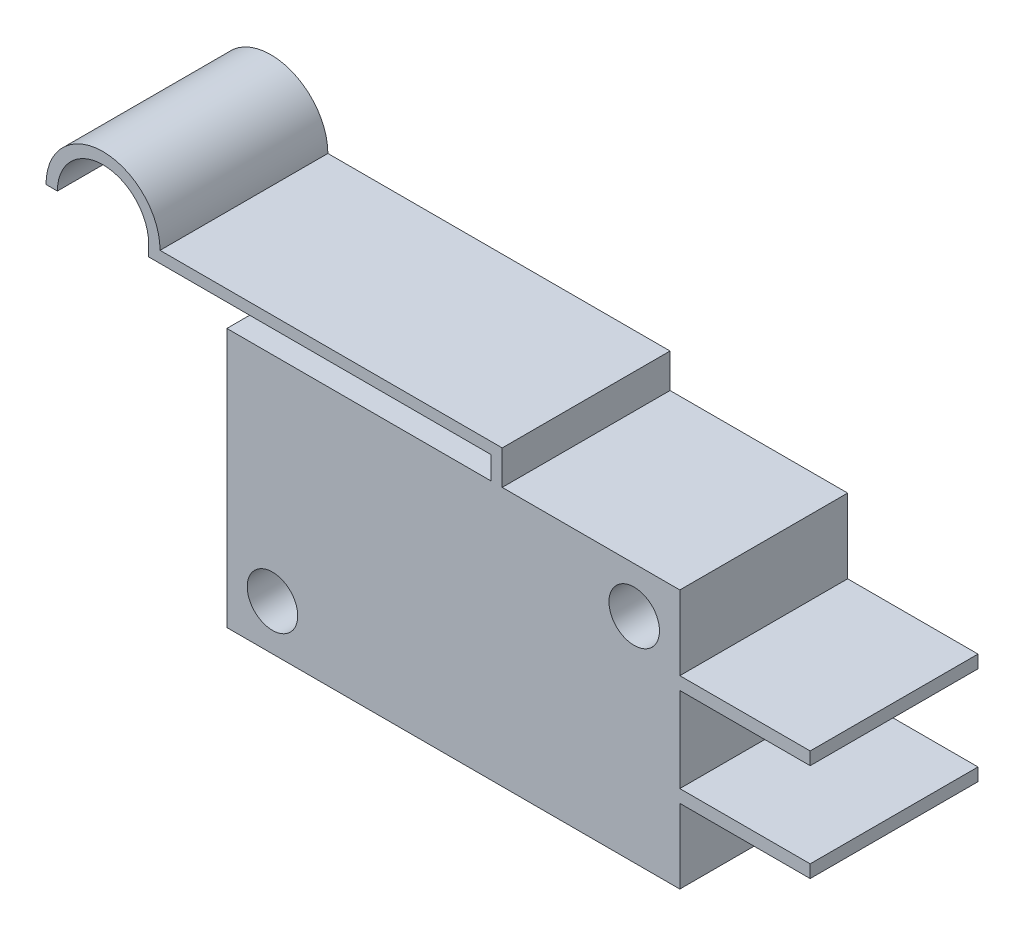
ISO-10303-21;
HEADER;
FILE_DESCRIPTION(('STEP AP214'),'2;1');
FILE_NAME('part.step','',(''),(''),'','','');
FILE_SCHEMA(('AUTOMOTIVE_DESIGN { 1 0 10303 214 1 1 1 1 }'));
ENDSEC;
DATA;
#1=APPLICATION_CONTEXT('core data for automotive mechanical design processes');
#2=APPLICATION_PROTOCOL_DEFINITION('international standard','automotive_design',2000,#1);
#3=PRODUCT_CONTEXT('',#1,'mechanical');
#4=PRODUCT('Part','Part','',(#3));
#5=PRODUCT_RELATED_PRODUCT_CATEGORY('part','',(#4));
#6=PRODUCT_DEFINITION_FORMATION('','',#4);
#7=PRODUCT_DEFINITION_CONTEXT('part definition',#1,'design');
#8=PRODUCT_DEFINITION('design','',#6,#7);
#9=PRODUCT_DEFINITION_SHAPE('','',#8);
#10=(LENGTH_UNIT() NAMED_UNIT(*) SI_UNIT(.MILLI.,.METRE.));
#11=(NAMED_UNIT(*) PLANE_ANGLE_UNIT() SI_UNIT($,.RADIAN.));
#12=(NAMED_UNIT(*) SI_UNIT($,.STERADIAN.) SOLID_ANGLE_UNIT());
#13=UNCERTAINTY_MEASURE_WITH_UNIT(LENGTH_MEASURE(1.E-05),#10,'distance_accuracy_value','');
#14=(GEOMETRIC_REPRESENTATION_CONTEXT(3) GLOBAL_UNCERTAINTY_ASSIGNED_CONTEXT((#13)) GLOBAL_UNIT_ASSIGNED_CONTEXT((#10,
#11,#12)) REPRESENTATION_CONTEXT('',''));
#15=CARTESIAN_POINT('',(0.,0.,0.));
#16=DIRECTION('',(0.,0.,1.));
#17=DIRECTION('',(1.,0.,0.));
#18=AXIS2_PLACEMENT_3D('',#15,#16,#17);
#19=CARTESIAN_POINT('',(0.,15.9,10.3));
#20=DIRECTION('',(0.,-1.,0.));
#21=DIRECTION('',(0.,0.,-1.));
#22=AXIS2_PLACEMENT_3D('',#19,#20,#21);
#23=PLANE('',#22);
#24=DIRECTION('',(0.,0.,1.));
#25=VECTOR('',#24,1.);
#26=CARTESIAN_POINT('',(-11.6,15.9,0.));
#27=LINE('',#26,#25);
#28=CARTESIAN_POINT('',(-11.6,15.9,0.));
#29=VERTEX_POINT('',#28);
#30=CARTESIAN_POINT('',(-11.6,15.9,10.3));
#31=VERTEX_POINT('',#30);
#32=EDGE_CURVE('E246',#29,#31,#27,.T.);
#33=ORIENTED_EDGE('',*,*,#32,.F.);
#34=DIRECTION('',(-1.,0.,0.));
#35=VECTOR('',#34,1.);
#36=CARTESIAN_POINT('',(0.,15.9,0.));
#37=LINE('',#36,#35);
#38=CARTESIAN_POINT('',(-27.8,15.9,0.));
#39=VERTEX_POINT('',#38);
#40=EDGE_CURVE('E334',#29,#39,#37,.T.);
#41=ORIENTED_EDGE('',*,*,#40,.T.);
#42=DIRECTION('',(0.,0.,-1.));
#43=VECTOR('',#42,1.);
#44=CARTESIAN_POINT('',(-27.8,15.9,10.3));
#45=LINE('',#44,#43);
#46=CARTESIAN_POINT('',(-27.8,15.9,10.3));
#47=VERTEX_POINT('',#46);
#48=EDGE_CURVE('E43',#47,#39,#45,.T.);
#49=ORIENTED_EDGE('',*,*,#48,.F.);
#50=DIRECTION('',(-1.,0.,0.));
#51=VECTOR('',#50,1.);
#52=CARTESIAN_POINT('',(0.,15.9,10.3));
#53=LINE('',#52,#51);
#54=EDGE_CURVE('E322',#31,#47,#53,.T.);
#55=ORIENTED_EDGE('',*,*,#54,.F.);
#56=EDGE_LOOP('',(#33,#41,#49,#55));
#57=FACE_BOUND('',#56,.T.);
#58=ADVANCED_FACE('F35',(#57),#23,.F.);
#59=CARTESIAN_POINT('',(0.,0.,10.3));
#60=DIRECTION('',(-1.,0.,0.));
#61=DIRECTION('',(0.,0.,1.));
#62=AXIS2_PLACEMENT_3D('',#59,#60,#61);
#63=PLANE('',#62);
#64=DIRECTION('',(0.,1.,0.));
#65=VECTOR('',#64,1.);
#66=CARTESIAN_POINT('',(0.,0.,10.3));
#67=LINE('',#66,#65);
#68=CARTESIAN_POINT('',(0.,5.34249416077182,10.3));
#69=VERTEX_POINT('',#68);
#70=CARTESIAN_POINT('',(0.,10.5575058392282,10.3));
#71=VERTEX_POINT('',#70);
#72=EDGE_CURVE('E58',#69,#71,#67,.T.);
#73=ORIENTED_EDGE('',*,*,#72,.F.);
#74=DIRECTION('',(0.,0.,1.));
#75=VECTOR('',#74,1.);
#76=CARTESIAN_POINT('',(0.,5.34249416077182,0.));
#77=LINE('',#76,#75);
#78=CARTESIAN_POINT('',(0.,5.34249416077182,0.));
#79=VERTEX_POINT('',#78);
#80=EDGE_CURVE('E266',#79,#69,#77,.T.);
#81=ORIENTED_EDGE('',*,*,#80,.F.);
#82=DIRECTION('',(0.,1.,0.));
#83=VECTOR('',#82,1.);
#84=CARTESIAN_POINT('',(0.,0.,0.));
#85=LINE('',#84,#83);
#86=CARTESIAN_POINT('',(0.,10.5575058392282,0.));
#87=VERTEX_POINT('',#86);
#88=EDGE_CURVE('E335',#79,#87,#85,.T.);
#89=ORIENTED_EDGE('',*,*,#88,.T.);
#90=DIRECTION('',(0.,0.,1.));
#91=VECTOR('',#90,1.);
#92=CARTESIAN_POINT('',(0.,10.5575058392282,0.));
#93=LINE('',#92,#91);
#94=EDGE_CURVE('E291',#87,#71,#93,.T.);
#95=ORIENTED_EDGE('',*,*,#94,.T.);
#96=EDGE_LOOP('',(#73,#81,#89,#95));
#97=FACE_BOUND('',#96,.T.);
#98=ADVANCED_FACE('F381',(#97),#63,.F.);
#99=DIRECTION('',(0.,0.,1.));
#100=VECTOR('',#99,1.);
#101=CARTESIAN_POINT('',(0.,11.3424941607718,0.));
#102=LINE('',#101,#100);
#103=CARTESIAN_POINT('',(0.,11.3424941607718,0.));
#104=VERTEX_POINT('',#103);
#105=CARTESIAN_POINT('',(0.,11.3424941607718,10.3));
#106=VERTEX_POINT('',#105);
#107=EDGE_CURVE('E299',#104,#106,#102,.T.);
#108=ORIENTED_EDGE('',*,*,#107,.F.);
#109=CARTESIAN_POINT('',(0.,15.9,0.));
#110=VERTEX_POINT('',#109);
#111=EDGE_CURVE('E316',#104,#110,#85,.T.);
#112=ORIENTED_EDGE('',*,*,#111,.T.);
#113=DIRECTION('',(0.,0.,-1.));
#114=VECTOR('',#113,1.);
#115=CARTESIAN_POINT('',(0.,15.9,10.3));
#116=LINE('',#115,#114);
#117=CARTESIAN_POINT('',(0.,15.9,10.3));
#118=VERTEX_POINT('',#117);
#119=EDGE_CURVE('E11',#118,#110,#116,.T.);
#120=ORIENTED_EDGE('',*,*,#119,.F.);
#121=EDGE_CURVE('E323',#106,#118,#67,.T.);
#122=ORIENTED_EDGE('',*,*,#121,.F.);
#123=EDGE_LOOP('',(#108,#112,#120,#122));
#124=FACE_BOUND('',#123,.T.);
#125=ADVANCED_FACE('F398',(#124),#63,.F.);
#126=CARTESIAN_POINT('',(0.,0.,0.));
#127=VERTEX_POINT('',#126);
#128=CARTESIAN_POINT('',(0.,4.55750583922818,0.));
#129=VERTEX_POINT('',#128);
#130=EDGE_CURVE('E332',#127,#129,#85,.T.);
#131=ORIENTED_EDGE('',*,*,#130,.T.);
#132=DIRECTION('',(0.,0.,1.));
#133=VECTOR('',#132,1.);
#134=CARTESIAN_POINT('',(0.,4.55750583922818,0.));
#135=LINE('',#134,#133);
#136=CARTESIAN_POINT('',(0.,4.55750583922818,10.3));
#137=VERTEX_POINT('',#136);
#138=EDGE_CURVE('E279',#129,#137,#135,.T.);
#139=ORIENTED_EDGE('',*,*,#138,.T.);
#140=CARTESIAN_POINT('',(0.,0.,10.3));
#141=VERTEX_POINT('',#140);
#142=EDGE_CURVE('E319',#141,#137,#67,.T.);
#143=ORIENTED_EDGE('',*,*,#142,.F.);
#144=DIRECTION('',(0.,0.,-1.));
#145=VECTOR('',#144,1.);
#146=CARTESIAN_POINT('',(0.,0.,10.3));
#147=LINE('',#146,#145);
#148=EDGE_CURVE('E331',#141,#127,#147,.T.);
#149=ORIENTED_EDGE('',*,*,#148,.T.);
#150=EDGE_LOOP('',(#131,#139,#143,#149));
#151=FACE_BOUND('',#150,.T.);
#152=ADVANCED_FACE('F37',(#151),#63,.F.);
#153=CARTESIAN_POINT('',(-10.9,15.9,0.));
#154=VERTEX_POINT('',#153);
#155=EDGE_CURVE('E336',#110,#154,#37,.T.);
#156=ORIENTED_EDGE('',*,*,#155,.T.);
#157=DIRECTION('',(0.,0.,1.));
#158=VECTOR('',#157,1.);
#159=CARTESIAN_POINT('',(-10.9,15.9,0.));
#160=LINE('',#159,#158);
#161=CARTESIAN_POINT('',(-10.9,15.9,10.3));
#162=VERTEX_POINT('',#161);
#163=EDGE_CURVE('E244',#154,#162,#160,.T.);
#164=ORIENTED_EDGE('',*,*,#163,.T.);
#165=EDGE_CURVE('E324',#118,#162,#53,.T.);
#166=ORIENTED_EDGE('',*,*,#165,.F.);
#167=ORIENTED_EDGE('',*,*,#119,.T.);
#168=EDGE_LOOP('',(#156,#164,#166,#167));
#169=FACE_BOUND('',#168,.T.);
#170=ADVANCED_FACE('F404',(#169),#23,.F.);
#171=CARTESIAN_POINT('',(-27.8,0.,10.3));
#172=DIRECTION('',(1.,0.,0.));
#173=DIRECTION('',(0.,0.,-1.));
#174=AXIS2_PLACEMENT_3D('',#171,#172,#173);
#175=PLANE('',#174);
#176=DIRECTION('',(0.,-1.,0.));
#177=VECTOR('',#176,1.);
#178=CARTESIAN_POINT('',(-27.8,0.,0.));
#179=LINE('',#178,#177);
#180=CARTESIAN_POINT('',(-27.8,0.,0.));
#181=VERTEX_POINT('',#180);
#182=EDGE_CURVE('E339',#39,#181,#179,.T.);
#183=ORIENTED_EDGE('',*,*,#182,.T.);
#184=DIRECTION('',(0.,0.,-1.));
#185=VECTOR('',#184,1.);
#186=CARTESIAN_POINT('',(-27.8,0.,10.3));
#187=LINE('',#186,#185);
#188=CARTESIAN_POINT('',(-27.8,0.,10.3));
#189=VERTEX_POINT('',#188);
#190=EDGE_CURVE('E345',#189,#181,#187,.T.);
#191=ORIENTED_EDGE('',*,*,#190,.F.);
#192=DIRECTION('',(0.,-1.,0.));
#193=VECTOR('',#192,1.);
#194=CARTESIAN_POINT('',(-27.8,0.,10.3));
#195=LINE('',#194,#193);
#196=EDGE_CURVE('E327',#47,#189,#195,.T.);
#197=ORIENTED_EDGE('',*,*,#196,.F.);
#198=ORIENTED_EDGE('',*,*,#48,.T.);
#199=EDGE_LOOP('',(#183,#191,#197,#198));
#200=FACE_BOUND('',#199,.T.);
#201=ADVANCED_FACE('F352',(#200),#175,.F.);
#202=CARTESIAN_POINT('',(0.,0.,10.3));
#203=DIRECTION('',(0.,1.,0.));
#204=DIRECTION('',(-1.,0.,0.));
#205=AXIS2_PLACEMENT_3D('',#202,#203,#204);
#206=PLANE('',#205);
#207=DIRECTION('',(1.,0.,0.));
#208=VECTOR('',#207,1.);
#209=CARTESIAN_POINT('',(0.,0.,0.));
#210=LINE('',#209,#208);
#211=EDGE_CURVE('E341',#181,#127,#210,.T.);
#212=ORIENTED_EDGE('',*,*,#211,.T.);
#213=ORIENTED_EDGE('',*,*,#148,.F.);
#214=DIRECTION('',(1.,0.,0.));
#215=VECTOR('',#214,1.);
#216=CARTESIAN_POINT('',(0.,0.,10.3));
#217=LINE('',#216,#215);
#218=EDGE_CURVE('E329',#189,#141,#217,.T.);
#219=ORIENTED_EDGE('',*,*,#218,.F.);
#220=ORIENTED_EDGE('',*,*,#190,.T.);
#221=EDGE_LOOP('',(#212,#213,#219,#220));
#222=FACE_BOUND('',#221,.T.);
#223=ADVANCED_FACE('F362',(#222),#206,.F.);
#224=CARTESIAN_POINT('',(0.,0.,10.3));
#225=DIRECTION('',(0.,0.,1.));
#226=DIRECTION('',(1.,0.,0.));
#227=AXIS2_PLACEMENT_3D('',#224,#225,#226);
#228=PLANE('',#227);
#229=CARTESIAN_POINT('',(-25.,2.8,10.3));
#230=DIRECTION('',(0.,0.,1.));
#231=DIRECTION('',(1.,0.,0.));
#232=AXIS2_PLACEMENT_3D('',#229,#230,#231);
#233=CIRCLE('',#232,1.55);
#234=CARTESIAN_POINT('',(-23.45,2.8,10.3));
#235=VERTEX_POINT('',#234);
#236=EDGE_CURVE('E301',#235,#235,#233,.T.);
#237=ORIENTED_EDGE('',*,*,#236,.F.);
#238=EDGE_LOOP('',(#237));
#239=FACE_BOUND('',#238,.T.);
#240=CARTESIAN_POINT('',(-2.8,13.1,10.3));
#241=DIRECTION('',(0.,0.,1.));
#242=DIRECTION('',(1.,0.,0.));
#243=AXIS2_PLACEMENT_3D('',#240,#241,#242);
#244=CIRCLE('',#243,1.55);
#245=CARTESIAN_POINT('',(-1.25,13.1,10.3));
#246=VERTEX_POINT('',#245);
#247=EDGE_CURVE('E310',#246,#246,#244,.T.);
#248=ORIENTED_EDGE('',*,*,#247,.F.);
#249=EDGE_LOOP('',(#248));
#250=FACE_BOUND('',#249,.T.);
#251=ORIENTED_EDGE('',*,*,#142,.T.);
#252=DIRECTION('',(1.,0.,0.));
#253=VECTOR('',#252,1.);
#254=CARTESIAN_POINT('',(0.,4.55750583922818,10.3));
#255=LINE('',#254,#253);
#256=CARTESIAN_POINT('',(8.,4.55750583922818,10.3));
#257=VERTEX_POINT('',#256);
#258=EDGE_CURVE('E269',#137,#257,#255,.T.);
#259=ORIENTED_EDGE('',*,*,#258,.T.);
#260=DIRECTION('',(0.,1.,0.));
#261=VECTOR('',#260,1.);
#262=CARTESIAN_POINT('',(8.,5.34249416077182,10.3));
#263=LINE('',#262,#261);
#264=CARTESIAN_POINT('',(8.,5.34249416077182,10.3));
#265=VERTEX_POINT('',#264);
#266=EDGE_CURVE('E260',#257,#265,#263,.T.);
#267=ORIENTED_EDGE('',*,*,#266,.T.);
#268=DIRECTION('',(-1.,0.,0.));
#269=VECTOR('',#268,1.);
#270=CARTESIAN_POINT('',(0.,5.34249416077182,10.3));
#271=LINE('',#270,#269);
#272=EDGE_CURVE('E241',#265,#69,#271,.T.);
#273=ORIENTED_EDGE('',*,*,#272,.T.);
#274=ORIENTED_EDGE('',*,*,#72,.T.);
#275=DIRECTION('',(1.,0.,0.));
#276=VECTOR('',#275,1.);
#277=CARTESIAN_POINT('',(0.,10.5575058392282,10.3));
#278=LINE('',#277,#276);
#279=CARTESIAN_POINT('',(8.,10.5575058392282,10.3));
#280=VERTEX_POINT('',#279);
#281=EDGE_CURVE('E276',#71,#280,#278,.T.);
#282=ORIENTED_EDGE('',*,*,#281,.T.);
#283=DIRECTION('',(0.,1.,0.));
#284=VECTOR('',#283,1.);
#285=CARTESIAN_POINT('',(8.,10.5575058392282,10.3));
#286=LINE('',#285,#284);
#287=CARTESIAN_POINT('',(8.,11.3424941607718,10.3));
#288=VERTEX_POINT('',#287);
#289=EDGE_CURVE('E294',#280,#288,#286,.T.);
#290=ORIENTED_EDGE('',*,*,#289,.T.);
#291=DIRECTION('',(-1.,0.,0.));
#292=VECTOR('',#291,1.);
#293=CARTESIAN_POINT('',(0.,11.3424941607718,10.3));
#294=LINE('',#293,#292);
#295=EDGE_CURVE('E286',#288,#106,#294,.T.);
#296=ORIENTED_EDGE('',*,*,#295,.T.);
#297=ORIENTED_EDGE('',*,*,#121,.T.);
#298=ORIENTED_EDGE('',*,*,#165,.T.);
#299=DIRECTION('',(0.,1.,0.));
#300=VECTOR('',#299,1.);
#301=CARTESIAN_POINT('',(-10.9,18.,10.3));
#302=LINE('',#301,#300);
#303=CARTESIAN_POINT('',(-10.9,18.,10.3));
#304=VERTEX_POINT('',#303);
#305=EDGE_CURVE('E50',#162,#304,#302,.T.);
#306=ORIENTED_EDGE('',*,*,#305,.T.);
#307=DIRECTION('',(-1.,0.,0.));
#308=VECTOR('',#307,1.);
#309=CARTESIAN_POINT('',(-31.9,18.,10.3));
#310=LINE('',#309,#308);
#311=CARTESIAN_POINT('',(-31.9,18.,10.3));
#312=VERTEX_POINT('',#311);
#313=EDGE_CURVE('E207',#304,#312,#310,.T.);
#314=ORIENTED_EDGE('',*,*,#313,.T.);
#315=CARTESIAN_POINT('',(-35.4,18.,10.3));
#316=DIRECTION('',(0.,0.,1.));
#317=DIRECTION('',(1.,0.,0.));
#318=AXIS2_PLACEMENT_3D('',#315,#316,#317);
#319=CIRCLE('',#318,3.5);
#320=CARTESIAN_POINT('',(-38.9,18.,10.3));
#321=VERTEX_POINT('',#320);
#322=EDGE_CURVE('E224',#312,#321,#319,.T.);
#323=ORIENTED_EDGE('',*,*,#322,.T.);
#324=DIRECTION('',(1.,0.,0.));
#325=VECTOR('',#324,1.);
#326=CARTESIAN_POINT('',(-38.9,18.,10.3));
#327=LINE('',#326,#325);
#328=CARTESIAN_POINT('',(-38.2,18.,10.3));
#329=VERTEX_POINT('',#328);
#330=EDGE_CURVE('E185',#321,#329,#327,.T.);
#331=ORIENTED_EDGE('',*,*,#330,.T.);
#332=CARTESIAN_POINT('',(-35.4,18.,10.3));
#333=DIRECTION('',(0.,0.,-1.));
#334=DIRECTION('',(1.,0.,0.));
#335=AXIS2_PLACEMENT_3D('',#332,#333,#334);
#336=CIRCLE('',#335,2.8);
#337=CARTESIAN_POINT('',(-32.6,18.,10.3));
#338=VERTEX_POINT('',#337);
#339=EDGE_CURVE('E227',#329,#338,#336,.T.);
#340=ORIENTED_EDGE('',*,*,#339,.T.);
#341=DIRECTION('',(0.,-1.,0.));
#342=VECTOR('',#341,1.);
#343=CARTESIAN_POINT('',(-32.6,18.,10.3));
#344=LINE('',#343,#342);
#345=CARTESIAN_POINT('',(-32.6,17.3,10.3));
#346=VERTEX_POINT('',#345);
#347=EDGE_CURVE('E230',#338,#346,#344,.T.);
#348=ORIENTED_EDGE('',*,*,#347,.T.);
#349=DIRECTION('',(1.,0.,0.));
#350=VECTOR('',#349,1.);
#351=CARTESIAN_POINT('',(-31.8963387594044,17.3,10.3));
#352=LINE('',#351,#350);
#353=CARTESIAN_POINT('',(-11.6,17.3,10.3));
#354=VERTEX_POINT('',#353);
#355=EDGE_CURVE('E233',#346,#354,#352,.T.);
#356=ORIENTED_EDGE('',*,*,#355,.T.);
#357=DIRECTION('',(0.,-1.,0.));
#358=VECTOR('',#357,1.);
#359=CARTESIAN_POINT('',(-11.6,17.3,10.3));
#360=LINE('',#359,#358);
#361=EDGE_CURVE('E236',#354,#31,#360,.T.);
#362=ORIENTED_EDGE('',*,*,#361,.T.);
#363=ORIENTED_EDGE('',*,*,#54,.T.);
#364=ORIENTED_EDGE('',*,*,#196,.T.);
#365=ORIENTED_EDGE('',*,*,#218,.T.);
#366=EDGE_LOOP('',(#251,#259,#267,#273,#274,#282,#290,#296,#297,#298,#306,#314,#323,#331,#340,
#348,#356,#362,#363,#364,#365));
#367=FACE_BOUND('',#366,.T.);
#368=ADVANCED_FACE('F369',(#239,#250,#367),#228,.T.);
#369=CARTESIAN_POINT('',(0.,0.,0.));
#370=DIRECTION('',(0.,0.,1.));
#371=DIRECTION('',(1.,0.,0.));
#372=AXIS2_PLACEMENT_3D('',#369,#370,#371);
#373=PLANE('',#372);
#374=CARTESIAN_POINT('',(-25.,2.8,0.));
#375=DIRECTION('',(0.,0.,1.));
#376=DIRECTION('',(1.,0.,0.));
#377=AXIS2_PLACEMENT_3D('',#374,#375,#376);
#378=CIRCLE('',#377,1.55);
#379=CARTESIAN_POINT('',(-23.45,2.8,0.));
#380=VERTEX_POINT('',#379);
#381=EDGE_CURVE('E307',#380,#380,#378,.T.);
#382=ORIENTED_EDGE('',*,*,#381,.T.);
#383=EDGE_LOOP('',(#382));
#384=FACE_BOUND('',#383,.T.);
#385=CARTESIAN_POINT('',(-2.8,13.1,0.));
#386=DIRECTION('',(0.,0.,1.));
#387=DIRECTION('',(1.,0.,0.));
#388=AXIS2_PLACEMENT_3D('',#385,#386,#387);
#389=CIRCLE('',#388,1.55);
#390=CARTESIAN_POINT('',(-1.25,13.1,0.));
#391=VERTEX_POINT('',#390);
#392=EDGE_CURVE('E313',#391,#391,#389,.T.);
#393=ORIENTED_EDGE('',*,*,#392,.T.);
#394=EDGE_LOOP('',(#393));
#395=FACE_BOUND('',#394,.T.);
#396=ORIENTED_EDGE('',*,*,#130,.F.);
#397=ORIENTED_EDGE('',*,*,#211,.F.);
#398=ORIENTED_EDGE('',*,*,#182,.F.);
#399=ORIENTED_EDGE('',*,*,#40,.F.);
#400=DIRECTION('',(0.,-1.,0.));
#401=VECTOR('',#400,1.);
#402=CARTESIAN_POINT('',(-11.6,17.3,0.));
#403=LINE('',#402,#401);
#404=CARTESIAN_POINT('',(-11.6,17.3,0.));
#405=VERTEX_POINT('',#404);
#406=EDGE_CURVE('E218',#405,#29,#403,.T.);
#407=ORIENTED_EDGE('',*,*,#406,.F.);
#408=DIRECTION('',(1.,0.,0.));
#409=VECTOR('',#408,1.);
#410=CARTESIAN_POINT('',(-32.6,17.3,0.));
#411=LINE('',#410,#409);
#412=CARTESIAN_POINT('',(-32.6,17.3,0.));
#413=VERTEX_POINT('',#412);
#414=EDGE_CURVE('E216',#413,#405,#411,.T.);
#415=ORIENTED_EDGE('',*,*,#414,.F.);
#416=DIRECTION('',(0.,-1.,0.));
#417=VECTOR('',#416,1.);
#418=CARTESIAN_POINT('',(-32.6,18.,0.));
#419=LINE('',#418,#417);
#420=CARTESIAN_POINT('',(-32.6,18.,0.));
#421=VERTEX_POINT('',#420);
#422=EDGE_CURVE('E213',#421,#413,#419,.T.);
#423=ORIENTED_EDGE('',*,*,#422,.F.);
#424=CARTESIAN_POINT('',(-35.4,18.,0.));
#425=DIRECTION('',(0.,0.,-1.));
#426=DIRECTION('',(1.,0.,0.));
#427=AXIS2_PLACEMENT_3D('',#424,#425,#426);
#428=CIRCLE('',#427,2.8);
#429=CARTESIAN_POINT('',(-38.2,18.,0.));
#430=VERTEX_POINT('',#429);
#431=EDGE_CURVE('E202',#430,#421,#428,.T.);
#432=ORIENTED_EDGE('',*,*,#431,.F.);
#433=DIRECTION('',(1.,0.,0.));
#434=VECTOR('',#433,1.);
#435=CARTESIAN_POINT('',(-38.9,18.,0.));
#436=LINE('',#435,#434);
#437=CARTESIAN_POINT('',(-38.9,18.,0.));
#438=VERTEX_POINT('',#437);
#439=EDGE_CURVE('E183',#438,#430,#436,.T.);
#440=ORIENTED_EDGE('',*,*,#439,.F.);
#441=CARTESIAN_POINT('',(-35.4,18.,0.));
#442=DIRECTION('',(0.,0.,1.));
#443=DIRECTION('',(1.,0.,0.));
#444=AXIS2_PLACEMENT_3D('',#441,#442,#443);
#445=CIRCLE('',#444,3.5);
#446=CARTESIAN_POINT('',(-31.9,18.,0.));
#447=VERTEX_POINT('',#446);
#448=EDGE_CURVE('E199',#447,#438,#445,.T.);
#449=ORIENTED_EDGE('',*,*,#448,.F.);
#450=DIRECTION('',(-1.,0.,0.));
#451=VECTOR('',#450,1.);
#452=CARTESIAN_POINT('',(-22.4524642145679,18.,0.));
#453=LINE('',#452,#451);
#454=CARTESIAN_POINT('',(-10.9,18.,0.));
#455=VERTEX_POINT('',#454);
#456=EDGE_CURVE('E191',#455,#447,#453,.T.);
#457=ORIENTED_EDGE('',*,*,#456,.F.);
#458=DIRECTION('',(0.,1.,0.));
#459=VECTOR('',#458,1.);
#460=CARTESIAN_POINT('',(-10.9,18.,0.));
#461=LINE('',#460,#459);
#462=EDGE_CURVE('E220',#154,#455,#461,.T.);
#463=ORIENTED_EDGE('',*,*,#462,.F.);
#464=ORIENTED_EDGE('',*,*,#155,.F.);
#465=ORIENTED_EDGE('',*,*,#111,.F.);
#466=DIRECTION('',(-1.,0.,0.));
#467=VECTOR('',#466,1.);
#468=CARTESIAN_POINT('',(0.,11.3424941607718,0.));
#469=LINE('',#468,#467);
#470=CARTESIAN_POINT('',(8.,11.3424941607718,0.));
#471=VERTEX_POINT('',#470);
#472=EDGE_CURVE('E289',#471,#104,#469,.T.);
#473=ORIENTED_EDGE('',*,*,#472,.F.);
#474=DIRECTION('',(0.,1.,0.));
#475=VECTOR('',#474,1.);
#476=CARTESIAN_POINT('',(8.,10.5575058392282,0.));
#477=LINE('',#476,#475);
#478=CARTESIAN_POINT('',(8.,10.5575058392282,0.));
#479=VERTEX_POINT('',#478);
#480=EDGE_CURVE('E285',#479,#471,#477,.T.);
#481=ORIENTED_EDGE('',*,*,#480,.F.);
#482=DIRECTION('',(1.,0.,0.));
#483=VECTOR('',#482,1.);
#484=CARTESIAN_POINT('',(0.,10.5575058392282,0.));
#485=LINE('',#484,#483);
#486=EDGE_CURVE('E282',#87,#479,#485,.T.);
#487=ORIENTED_EDGE('',*,*,#486,.F.);
#488=ORIENTED_EDGE('',*,*,#88,.F.);
#489=DIRECTION('',(-1.,0.,0.));
#490=VECTOR('',#489,1.);
#491=CARTESIAN_POINT('',(0.,5.34249416077182,0.));
#492=LINE('',#491,#490);
#493=CARTESIAN_POINT('',(8.,5.34249416077182,0.));
#494=VERTEX_POINT('',#493);
#495=EDGE_CURVE('E256',#494,#79,#492,.T.);
#496=ORIENTED_EDGE('',*,*,#495,.F.);
#497=DIRECTION('',(0.,1.,0.));
#498=VECTOR('',#497,1.);
#499=CARTESIAN_POINT('',(8.,5.34249416077182,0.));
#500=LINE('',#499,#498);
#501=CARTESIAN_POINT('',(8.,4.55750583922818,0.));
#502=VERTEX_POINT('',#501);
#503=EDGE_CURVE('E263',#502,#494,#500,.T.);
#504=ORIENTED_EDGE('',*,*,#503,.F.);
#505=DIRECTION('',(1.,0.,0.));
#506=VECTOR('',#505,1.);
#507=CARTESIAN_POINT('',(0.,4.55750583922818,0.));
#508=LINE('',#507,#506);
#509=EDGE_CURVE('E259',#129,#502,#508,.T.);
#510=ORIENTED_EDGE('',*,*,#509,.F.);
#511=EDGE_LOOP('',(#396,#397,#398,#399,#407,#415,#423,#432,#440,#449,#457,#463,#464,#465,#473,
#481,#487,#488,#496,#504,#510));
#512=FACE_BOUND('',#511,.T.);
#513=ADVANCED_FACE('F197',(#384,#395,#512),#373,.F.);
#514=CARTESIAN_POINT('',(-2.8,13.1,0.));
#515=DIRECTION('',(0.,0.,1.));
#516=DIRECTION('',(1.,0.,0.));
#517=AXIS2_PLACEMENT_3D('',#514,#515,#516);
#518=CYLINDRICAL_SURFACE('',#517,1.55);
#519=ORIENTED_EDGE('',*,*,#392,.F.);
#520=EDGE_LOOP('',(#519));
#521=FACE_BOUND('',#520,.T.);
#522=ORIENTED_EDGE('',*,*,#247,.T.);
#523=EDGE_LOOP('',(#522));
#524=FACE_BOUND('',#523,.T.);
#525=ADVANCED_FACE('F450',(#521,#524),#518,.F.);
#526=CARTESIAN_POINT('',(-25.,2.8,0.));
#527=DIRECTION('',(0.,0.,1.));
#528=DIRECTION('',(1.,0.,0.));
#529=AXIS2_PLACEMENT_3D('',#526,#527,#528);
#530=CYLINDRICAL_SURFACE('',#529,1.55);
#531=ORIENTED_EDGE('',*,*,#381,.F.);
#532=EDGE_LOOP('',(#531));
#533=FACE_BOUND('',#532,.T.);
#534=ORIENTED_EDGE('',*,*,#236,.T.);
#535=EDGE_LOOP('',(#534));
#536=FACE_BOUND('',#535,.T.);
#537=ADVANCED_FACE('F445',(#533,#536),#530,.F.);
#538=CARTESIAN_POINT('',(0.,11.3424941607718,0.));
#539=DIRECTION('',(0.,1.,0.));
#540=DIRECTION('',(0.,0.,1.));
#541=AXIS2_PLACEMENT_3D('',#538,#539,#540);
#542=PLANE('',#541);
#543=ORIENTED_EDGE('',*,*,#295,.F.);
#544=DIRECTION('',(0.,0.,1.));
#545=VECTOR('',#544,1.);
#546=CARTESIAN_POINT('',(8.,11.3424941607718,0.));
#547=LINE('',#546,#545);
#548=EDGE_CURVE('E302',#471,#288,#547,.T.);
#549=ORIENTED_EDGE('',*,*,#548,.F.);
#550=ORIENTED_EDGE('',*,*,#472,.T.);
#551=ORIENTED_EDGE('',*,*,#107,.T.);
#552=EDGE_LOOP('',(#543,#549,#550,#551));
#553=FACE_BOUND('',#552,.T.);
#554=ADVANCED_FACE('F395',(#553),#542,.T.);
#555=CARTESIAN_POINT('',(8.,10.5575058392282,0.));
#556=DIRECTION('',(1.,0.,0.));
#557=DIRECTION('',(0.,0.,-1.));
#558=AXIS2_PLACEMENT_3D('',#555,#556,#557);
#559=PLANE('',#558);
#560=ORIENTED_EDGE('',*,*,#289,.F.);
#561=DIRECTION('',(0.,0.,1.));
#562=VECTOR('',#561,1.);
#563=CARTESIAN_POINT('',(8.,10.5575058392282,0.));
#564=LINE('',#563,#562);
#565=EDGE_CURVE('E304',#479,#280,#564,.T.);
#566=ORIENTED_EDGE('',*,*,#565,.F.);
#567=ORIENTED_EDGE('',*,*,#480,.T.);
#568=ORIENTED_EDGE('',*,*,#548,.T.);
#569=EDGE_LOOP('',(#560,#566,#567,#568));
#570=FACE_BOUND('',#569,.T.);
#571=ADVANCED_FACE('F391',(#570),#559,.T.);
#572=CARTESIAN_POINT('',(0.,10.5575058392282,0.));
#573=DIRECTION('',(0.,-1.,0.));
#574=DIRECTION('',(0.,0.,-1.));
#575=AXIS2_PLACEMENT_3D('',#572,#573,#574);
#576=PLANE('',#575);
#577=ORIENTED_EDGE('',*,*,#281,.F.);
#578=ORIENTED_EDGE('',*,*,#94,.F.);
#579=ORIENTED_EDGE('',*,*,#486,.T.);
#580=ORIENTED_EDGE('',*,*,#565,.T.);
#581=EDGE_LOOP('',(#577,#578,#579,#580));
#582=FACE_BOUND('',#581,.T.);
#583=ADVANCED_FACE('F385',(#582),#576,.T.);
#584=CARTESIAN_POINT('',(0.,5.34249416077182,0.));
#585=DIRECTION('',(0.,1.,0.));
#586=DIRECTION('',(0.,0.,1.));
#587=AXIS2_PLACEMENT_3D('',#584,#585,#586);
#588=PLANE('',#587);
#589=ORIENTED_EDGE('',*,*,#272,.F.);
#590=DIRECTION('',(0.,0.,1.));
#591=VECTOR('',#590,1.);
#592=CARTESIAN_POINT('',(8.,5.34249416077182,0.));
#593=LINE('',#592,#591);
#594=EDGE_CURVE('E274',#494,#265,#593,.T.);
#595=ORIENTED_EDGE('',*,*,#594,.F.);
#596=ORIENTED_EDGE('',*,*,#495,.T.);
#597=ORIENTED_EDGE('',*,*,#80,.T.);
#598=EDGE_LOOP('',(#589,#595,#596,#597));
#599=FACE_BOUND('',#598,.T.);
#600=ADVANCED_FACE('F379',(#599),#588,.T.);
#601=CARTESIAN_POINT('',(8.,5.34249416077182,0.));
#602=DIRECTION('',(1.,0.,0.));
#603=DIRECTION('',(0.,0.,-1.));
#604=AXIS2_PLACEMENT_3D('',#601,#602,#603);
#605=PLANE('',#604);
#606=ORIENTED_EDGE('',*,*,#266,.F.);
#607=DIRECTION('',(0.,0.,1.));
#608=VECTOR('',#607,1.);
#609=CARTESIAN_POINT('',(8.,4.55750583922818,0.));
#610=LINE('',#609,#608);
#611=EDGE_CURVE('E277',#502,#257,#610,.T.);
#612=ORIENTED_EDGE('',*,*,#611,.F.);
#613=ORIENTED_EDGE('',*,*,#503,.T.);
#614=ORIENTED_EDGE('',*,*,#594,.T.);
#615=EDGE_LOOP('',(#606,#612,#613,#614));
#616=FACE_BOUND('',#615,.T.);
#617=ADVANCED_FACE('F375',(#616),#605,.T.);
#618=CARTESIAN_POINT('',(0.,4.55750583922818,0.));
#619=DIRECTION('',(0.,-1.,0.));
#620=DIRECTION('',(0.,0.,-1.));
#621=AXIS2_PLACEMENT_3D('',#618,#619,#620);
#622=PLANE('',#621);
#623=ORIENTED_EDGE('',*,*,#258,.F.);
#624=ORIENTED_EDGE('',*,*,#138,.F.);
#625=ORIENTED_EDGE('',*,*,#509,.T.);
#626=ORIENTED_EDGE('',*,*,#611,.T.);
#627=EDGE_LOOP('',(#623,#624,#625,#626));
#628=FACE_BOUND('',#627,.T.);
#629=ADVANCED_FACE('F372',(#628),#622,.T.);
#630=CARTESIAN_POINT('',(-35.4,18.,0.));
#631=DIRECTION('',(0.,0.,1.));
#632=DIRECTION('',(1.,0.,0.));
#633=AXIS2_PLACEMENT_3D('',#630,#631,#632);
#634=CYLINDRICAL_SURFACE('',#633,3.5);
#635=ORIENTED_EDGE('',*,*,#322,.F.);
#636=DIRECTION('',(0.,0.,1.));
#637=VECTOR('',#636,1.);
#638=CARTESIAN_POINT('',(-31.9,18.,0.));
#639=LINE('',#638,#637);
#640=EDGE_CURVE('E206',#447,#312,#639,.T.);
#641=ORIENTED_EDGE('',*,*,#640,.F.);
#642=ORIENTED_EDGE('',*,*,#448,.T.);
#643=DIRECTION('',(0.,0.,1.));
#644=VECTOR('',#643,1.);
#645=CARTESIAN_POINT('',(-38.9,18.,0.));
#646=LINE('',#645,#644);
#647=EDGE_CURVE('E180',#438,#321,#646,.T.);
#648=ORIENTED_EDGE('',*,*,#647,.T.);
#649=EDGE_LOOP('',(#635,#641,#642,#648));
#650=FACE_BOUND('',#649,.T.);
#651=ADVANCED_FACE('F205',(#650),#634,.T.);
#652=CARTESIAN_POINT('',(-31.9,18.,0.));
#653=DIRECTION('',(0.,1.,0.));
#654=DIRECTION('',(0.,0.,1.));
#655=AXIS2_PLACEMENT_3D('',#652,#653,#654);
#656=PLANE('',#655);
#657=ORIENTED_EDGE('',*,*,#313,.F.);
#658=DIRECTION('',(0.,0.,1.));
#659=VECTOR('',#658,1.);
#660=CARTESIAN_POINT('',(-10.9,18.,0.));
#661=LINE('',#660,#659);
#662=EDGE_CURVE('E242',#455,#304,#661,.T.);
#663=ORIENTED_EDGE('',*,*,#662,.F.);
#664=ORIENTED_EDGE('',*,*,#456,.T.);
#665=ORIENTED_EDGE('',*,*,#640,.T.);
#666=EDGE_LOOP('',(#657,#663,#664,#665));
#667=FACE_BOUND('',#666,.T.);
#668=ADVANCED_FACE('F406',(#667),#656,.T.);
#669=CARTESIAN_POINT('',(-10.9,18.,0.));
#670=DIRECTION('',(1.,0.,0.));
#671=DIRECTION('',(0.,0.,-1.));
#672=AXIS2_PLACEMENT_3D('',#669,#670,#671);
#673=PLANE('',#672);
#674=ORIENTED_EDGE('',*,*,#305,.F.);
#675=ORIENTED_EDGE('',*,*,#163,.F.);
#676=ORIENTED_EDGE('',*,*,#462,.T.);
#677=ORIENTED_EDGE('',*,*,#662,.T.);
#678=EDGE_LOOP('',(#674,#675,#676,#677));
#679=FACE_BOUND('',#678,.T.);
#680=ADVANCED_FACE('F407',(#679),#673,.T.);
#681=CARTESIAN_POINT('',(-11.6,17.3,0.));
#682=DIRECTION('',(-1.,0.,0.));
#683=DIRECTION('',(0.,0.,1.));
#684=AXIS2_PLACEMENT_3D('',#681,#682,#683);
#685=PLANE('',#684);
#686=ORIENTED_EDGE('',*,*,#361,.F.);
#687=DIRECTION('',(0.,0.,1.));
#688=VECTOR('',#687,1.);
#689=CARTESIAN_POINT('',(-11.6,17.3,0.));
#690=LINE('',#689,#688);
#691=EDGE_CURVE('E248',#405,#354,#690,.T.);
#692=ORIENTED_EDGE('',*,*,#691,.F.);
#693=ORIENTED_EDGE('',*,*,#406,.T.);
#694=ORIENTED_EDGE('',*,*,#32,.T.);
#695=EDGE_LOOP('',(#686,#692,#693,#694));
#696=FACE_BOUND('',#695,.T.);
#697=ADVANCED_FACE('F409',(#696),#685,.T.);
#698=CARTESIAN_POINT('',(-31.8963387594044,17.3,0.));
#699=DIRECTION('',(0.,-1.,0.));
#700=DIRECTION('',(0.,0.,-1.));
#701=AXIS2_PLACEMENT_3D('',#698,#699,#700);
#702=PLANE('',#701);
#703=ORIENTED_EDGE('',*,*,#355,.F.);
#704=DIRECTION('',(0.,0.,1.));
#705=VECTOR('',#704,1.);
#706=CARTESIAN_POINT('',(-32.6,17.3,0.));
#707=LINE('',#706,#705);
#708=EDGE_CURVE('E250',#413,#346,#707,.T.);
#709=ORIENTED_EDGE('',*,*,#708,.F.);
#710=ORIENTED_EDGE('',*,*,#414,.T.);
#711=ORIENTED_EDGE('',*,*,#691,.T.);
#712=EDGE_LOOP('',(#703,#709,#710,#711));
#713=FACE_BOUND('',#712,.T.);
#714=ADVANCED_FACE('F415',(#713),#702,.T.);
#715=CARTESIAN_POINT('',(-32.6,18.,0.));
#716=DIRECTION('',(-1.,0.,0.));
#717=DIRECTION('',(0.,-1.,0.));
#718=AXIS2_PLACEMENT_3D('',#715,#716,#717);
#719=PLANE('',#718);
#720=ORIENTED_EDGE('',*,*,#347,.F.);
#721=DIRECTION('',(0.,0.,1.));
#722=VECTOR('',#721,1.);
#723=CARTESIAN_POINT('',(-32.6,18.,0.));
#724=LINE('',#723,#722);
#725=EDGE_CURVE('E253',#421,#338,#724,.T.);
#726=ORIENTED_EDGE('',*,*,#725,.F.);
#727=ORIENTED_EDGE('',*,*,#422,.T.);
#728=ORIENTED_EDGE('',*,*,#708,.T.);
#729=EDGE_LOOP('',(#720,#726,#727,#728));
#730=FACE_BOUND('',#729,.T.);
#731=ADVANCED_FACE('F593',(#730),#719,.T.);
#732=CARTESIAN_POINT('',(-35.4,18.,0.));
#733=DIRECTION('',(0.,0.,1.));
#734=DIRECTION('',(1.,0.,0.));
#735=AXIS2_PLACEMENT_3D('',#732,#733,#734);
#736=CYLINDRICAL_SURFACE('',#735,2.8);
#737=ORIENTED_EDGE('',*,*,#339,.F.);
#738=DIRECTION('',(0.,0.,1.));
#739=VECTOR('',#738,1.);
#740=CARTESIAN_POINT('',(-38.2,18.,0.));
#741=LINE('',#740,#739);
#742=EDGE_CURVE('E190',#430,#329,#741,.T.);
#743=ORIENTED_EDGE('',*,*,#742,.F.);
#744=ORIENTED_EDGE('',*,*,#431,.T.);
#745=ORIENTED_EDGE('',*,*,#725,.T.);
#746=EDGE_LOOP('',(#737,#743,#744,#745));
#747=FACE_BOUND('',#746,.T.);
#748=ADVANCED_FACE('F605',(#747),#736,.F.);
#749=CARTESIAN_POINT('',(-38.9,18.,0.));
#750=DIRECTION('',(0.,-1.,0.));
#751=DIRECTION('',(0.,0.,-1.));
#752=AXIS2_PLACEMENT_3D('',#749,#750,#751);
#753=PLANE('',#752);
#754=ORIENTED_EDGE('',*,*,#330,.F.);
#755=ORIENTED_EDGE('',*,*,#647,.F.);
#756=ORIENTED_EDGE('',*,*,#439,.T.);
#757=ORIENTED_EDGE('',*,*,#742,.T.);
#758=EDGE_LOOP('',(#754,#755,#756,#757));
#759=FACE_BOUND('',#758,.T.);
#760=ADVANCED_FACE('F182',(#759),#753,.T.);
#761=CLOSED_SHELL('',(#58,#98,#125,#152,#170,#201,#223,#368,#513,#525,#537,#554,#571,#583,#600,
#617,#629,#651,#668,#680,#697,#714,#731,#748,#760));
#762=MANIFOLD_SOLID_BREP('B2',#761);
#763=ADVANCED_BREP_SHAPE_REPRESENTATION('',(#18,#762),#14);
#764=SHAPE_DEFINITION_REPRESENTATION(#9,#763);
ENDSEC;
END-ISO-10303-21;
